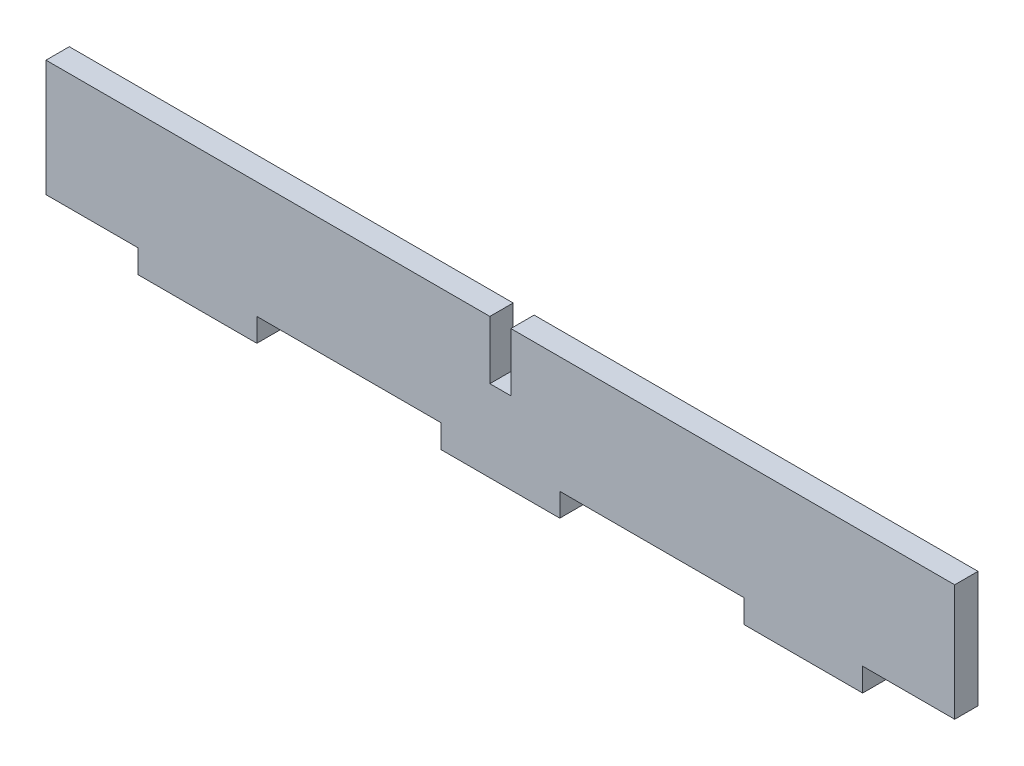
ISO-10303-21;
HEADER;
FILE_DESCRIPTION(('STEP AP214'),'2;1');
FILE_NAME('part.step','',(''),(''),'','','');
FILE_SCHEMA(('AUTOMOTIVE_DESIGN { 1 0 10303 214 1 1 1 1 }'));
ENDSEC;
DATA;
#1=APPLICATION_CONTEXT('core data for automotive mechanical design processes');
#2=APPLICATION_PROTOCOL_DEFINITION('international standard','automotive_design',2000,#1);
#3=PRODUCT_CONTEXT('',#1,'mechanical');
#4=PRODUCT('Part','Part','',(#3));
#5=PRODUCT_RELATED_PRODUCT_CATEGORY('part','',(#4));
#6=PRODUCT_DEFINITION_FORMATION('','',#4);
#7=PRODUCT_DEFINITION_CONTEXT('part definition',#1,'design');
#8=PRODUCT_DEFINITION('design','',#6,#7);
#9=PRODUCT_DEFINITION_SHAPE('','',#8);
#10=(LENGTH_UNIT() NAMED_UNIT(*) SI_UNIT(.MILLI.,.METRE.));
#11=(NAMED_UNIT(*) PLANE_ANGLE_UNIT() SI_UNIT($,.RADIAN.));
#12=(NAMED_UNIT(*) SI_UNIT($,.STERADIAN.) SOLID_ANGLE_UNIT());
#13=UNCERTAINTY_MEASURE_WITH_UNIT(LENGTH_MEASURE(1.E-05),#10,'distance_accuracy_value','');
#14=(GEOMETRIC_REPRESENTATION_CONTEXT(3) GLOBAL_UNCERTAINTY_ASSIGNED_CONTEXT((#13)) GLOBAL_UNIT_ASSIGNED_CONTEXT((#10,
#11,#12)) REPRESENTATION_CONTEXT('',''));
#15=CARTESIAN_POINT('',(0.,0.,0.));
#16=DIRECTION('',(0.,0.,1.));
#17=DIRECTION('',(1.,0.,0.));
#18=AXIS2_PLACEMENT_3D('',#15,#16,#17);
#19=CARTESIAN_POINT('',(-39.,1.99999999999999,2.));
#20=DIRECTION('',(1.,0.,0.));
#21=DIRECTION('',(0.,0.,-1.));
#22=AXIS2_PLACEMENT_3D('',#19,#20,#21);
#23=PLANE('',#22);
#24=DIRECTION('',(0.,-1.,0.));
#25=VECTOR('',#24,1.);
#26=CARTESIAN_POINT('',(-39.,1.99999999999999,0.));
#27=LINE('',#26,#25);
#28=CARTESIAN_POINT('',(-39.,12.,0.));
#29=VERTEX_POINT('',#28);
#30=CARTESIAN_POINT('',(-39.,1.99999999999999,0.));
#31=VERTEX_POINT('',#30);
#32=EDGE_CURVE('E200',#29,#31,#27,.T.);
#33=ORIENTED_EDGE('',*,*,#32,.T.);
#34=DIRECTION('',(0.,0.,-1.));
#35=VECTOR('',#34,1.);
#36=CARTESIAN_POINT('',(-39.,1.99999999999999,2.));
#37=LINE('',#36,#35);
#38=CARTESIAN_POINT('',(-39.,1.99999999999999,2.));
#39=VERTEX_POINT('',#38);
#40=EDGE_CURVE('E11',#39,#31,#37,.T.);
#41=ORIENTED_EDGE('',*,*,#40,.F.);
#42=DIRECTION('',(0.,-1.,0.));
#43=VECTOR('',#42,1.);
#44=CARTESIAN_POINT('',(-39.,1.99999999999999,2.));
#45=LINE('',#44,#43);
#46=CARTESIAN_POINT('',(-39.,12.,2.));
#47=VERTEX_POINT('',#46);
#48=EDGE_CURVE('E238',#47,#39,#45,.T.);
#49=ORIENTED_EDGE('',*,*,#48,.F.);
#50=DIRECTION('',(0.,0.,-1.));
#51=VECTOR('',#50,1.);
#52=CARTESIAN_POINT('',(-39.,12.,2.));
#53=LINE('',#52,#51);
#54=EDGE_CURVE('E196',#47,#29,#53,.T.);
#55=ORIENTED_EDGE('',*,*,#54,.T.);
#56=EDGE_LOOP('',(#33,#41,#49,#55));
#57=FACE_BOUND('',#56,.T.);
#58=ADVANCED_FACE('F32',(#57),#23,.F.);
#59=CARTESIAN_POINT('',(-39.,1.99999999999999,2.));
#60=DIRECTION('',(0.,1.,0.));
#61=DIRECTION('',(-1.,0.,0.));
#62=AXIS2_PLACEMENT_3D('',#59,#60,#61);
#63=PLANE('',#62);
#64=DIRECTION('',(1.,0.,0.));
#65=VECTOR('',#64,1.);
#66=CARTESIAN_POINT('',(-39.,1.99999999999999,0.));
#67=LINE('',#66,#65);
#68=CARTESIAN_POINT('',(-31.1,1.99999999999999,0.));
#69=VERTEX_POINT('',#68);
#70=EDGE_CURVE('E203',#31,#69,#67,.T.);
#71=ORIENTED_EDGE('',*,*,#70,.T.);
#72=DIRECTION('',(0.,0.,-1.));
#73=VECTOR('',#72,1.);
#74=CARTESIAN_POINT('',(-31.1,1.99999999999999,2.));
#75=LINE('',#74,#73);
#76=CARTESIAN_POINT('',(-31.1,1.99999999999999,2.));
#77=VERTEX_POINT('',#76);
#78=EDGE_CURVE('E40',#77,#69,#75,.T.);
#79=ORIENTED_EDGE('',*,*,#78,.F.);
#80=DIRECTION('',(1.,0.,0.));
#81=VECTOR('',#80,1.);
#82=CARTESIAN_POINT('',(-39.,1.99999999999999,2.));
#83=LINE('',#82,#81);
#84=EDGE_CURVE('E127',#39,#77,#83,.T.);
#85=ORIENTED_EDGE('',*,*,#84,.F.);
#86=ORIENTED_EDGE('',*,*,#40,.T.);
#87=EDGE_LOOP('',(#71,#79,#85,#86));
#88=FACE_BOUND('',#87,.T.);
#89=ADVANCED_FACE('F356',(#88),#63,.F.);
#90=CARTESIAN_POINT('',(-31.1,1.99999999999999,2.));
#91=DIRECTION('',(1.,0.,0.));
#92=DIRECTION('',(0.,0.,-1.));
#93=AXIS2_PLACEMENT_3D('',#90,#91,#92);
#94=PLANE('',#93);
#95=DIRECTION('',(0.,-1.,0.));
#96=VECTOR('',#95,1.);
#97=CARTESIAN_POINT('',(-31.1,1.99999999999999,0.));
#98=LINE('',#97,#96);
#99=CARTESIAN_POINT('',(-31.1,0.,0.));
#100=VERTEX_POINT('',#99);
#101=EDGE_CURVE('E205',#69,#100,#98,.T.);
#102=ORIENTED_EDGE('',*,*,#101,.T.);
#103=DIRECTION('',(0.,0.,-1.));
#104=VECTOR('',#103,1.);
#105=CARTESIAN_POINT('',(-31.1,0.,2.));
#106=LINE('',#105,#104);
#107=CARTESIAN_POINT('',(-31.1,0.,2.));
#108=VERTEX_POINT('',#107);
#109=EDGE_CURVE('E281',#108,#100,#106,.T.);
#110=ORIENTED_EDGE('',*,*,#109,.F.);
#111=DIRECTION('',(0.,-1.,0.));
#112=VECTOR('',#111,1.);
#113=CARTESIAN_POINT('',(-31.1,1.99999999999999,2.));
#114=LINE('',#113,#112);
#115=EDGE_CURVE('E289',#77,#108,#114,.T.);
#116=ORIENTED_EDGE('',*,*,#115,.F.);
#117=ORIENTED_EDGE('',*,*,#78,.T.);
#118=EDGE_LOOP('',(#102,#110,#116,#117));
#119=FACE_BOUND('',#118,.T.);
#120=ADVANCED_FACE('F287',(#119),#94,.F.);
#121=CARTESIAN_POINT('',(-31.1,0.,2.));
#122=DIRECTION('',(0.,1.,0.));
#123=DIRECTION('',(-1.,0.,0.));
#124=AXIS2_PLACEMENT_3D('',#121,#122,#123);
#125=PLANE('',#124);
#126=DIRECTION('',(1.,0.,0.));
#127=VECTOR('',#126,1.);
#128=CARTESIAN_POINT('',(-31.1,0.,0.));
#129=LINE('',#128,#127);
#130=CARTESIAN_POINT('',(-20.9,0.,0.));
#131=VERTEX_POINT('',#130);
#132=EDGE_CURVE('E207',#100,#131,#129,.T.);
#133=ORIENTED_EDGE('',*,*,#132,.T.);
#134=DIRECTION('',(0.,0.,-1.));
#135=VECTOR('',#134,1.);
#136=CARTESIAN_POINT('',(-20.9,0.,2.));
#137=LINE('',#136,#135);
#138=CARTESIAN_POINT('',(-20.9,0.,2.));
#139=VERTEX_POINT('',#138);
#140=EDGE_CURVE('E278',#139,#131,#137,.T.);
#141=ORIENTED_EDGE('',*,*,#140,.F.);
#142=DIRECTION('',(1.,0.,0.));
#143=VECTOR('',#142,1.);
#144=CARTESIAN_POINT('',(-31.1,0.,2.));
#145=LINE('',#144,#143);
#146=EDGE_CURVE('E307',#108,#139,#145,.T.);
#147=ORIENTED_EDGE('',*,*,#146,.F.);
#148=ORIENTED_EDGE('',*,*,#109,.T.);
#149=EDGE_LOOP('',(#133,#141,#147,#148));
#150=FACE_BOUND('',#149,.T.);
#151=ADVANCED_FACE('F298',(#150),#125,.F.);
#152=CARTESIAN_POINT('',(-20.9,2.,2.));
#153=DIRECTION('',(-1.,0.,0.));
#154=DIRECTION('',(0.,0.,1.));
#155=AXIS2_PLACEMENT_3D('',#152,#153,#154);
#156=PLANE('',#155);
#157=DIRECTION('',(0.,1.,0.));
#158=VECTOR('',#157,1.);
#159=CARTESIAN_POINT('',(-20.9,2.,0.));
#160=LINE('',#159,#158);
#161=CARTESIAN_POINT('',(-20.9,2.,0.));
#162=VERTEX_POINT('',#161);
#163=EDGE_CURVE('E209',#131,#162,#160,.T.);
#164=ORIENTED_EDGE('',*,*,#163,.T.);
#165=DIRECTION('',(0.,0.,-1.));
#166=VECTOR('',#165,1.);
#167=CARTESIAN_POINT('',(-20.9,2.,2.));
#168=LINE('',#167,#166);
#169=CARTESIAN_POINT('',(-20.9,2.,2.));
#170=VERTEX_POINT('',#169);
#171=EDGE_CURVE('E275',#170,#162,#168,.T.);
#172=ORIENTED_EDGE('',*,*,#171,.F.);
#173=DIRECTION('',(0.,1.,0.));
#174=VECTOR('',#173,1.);
#175=CARTESIAN_POINT('',(-20.9,2.,2.));
#176=LINE('',#175,#174);
#177=EDGE_CURVE('E304',#139,#170,#176,.T.);
#178=ORIENTED_EDGE('',*,*,#177,.F.);
#179=ORIENTED_EDGE('',*,*,#140,.T.);
#180=EDGE_LOOP('',(#164,#172,#178,#179));
#181=FACE_BOUND('',#180,.T.);
#182=ADVANCED_FACE('F302',(#181),#156,.F.);
#183=CARTESIAN_POINT('',(-20.9,2.,2.));
#184=DIRECTION('',(0.,1.,0.));
#185=DIRECTION('',(-1.,0.,0.));
#186=AXIS2_PLACEMENT_3D('',#183,#184,#185);
#187=PLANE('',#186);
#188=DIRECTION('',(1.,0.,0.));
#189=VECTOR('',#188,1.);
#190=CARTESIAN_POINT('',(-20.9,2.,0.));
#191=LINE('',#190,#189);
#192=CARTESIAN_POINT('',(-5.1,2.,0.));
#193=VERTEX_POINT('',#192);
#194=EDGE_CURVE('E211',#162,#193,#191,.T.);
#195=ORIENTED_EDGE('',*,*,#194,.T.);
#196=DIRECTION('',(0.,0.,-1.));
#197=VECTOR('',#196,1.);
#198=CARTESIAN_POINT('',(-5.1,2.,2.));
#199=LINE('',#198,#197);
#200=CARTESIAN_POINT('',(-5.1,2.,2.));
#201=VERTEX_POINT('',#200);
#202=EDGE_CURVE('E272',#201,#193,#199,.T.);
#203=ORIENTED_EDGE('',*,*,#202,.F.);
#204=DIRECTION('',(1.,0.,0.));
#205=VECTOR('',#204,1.);
#206=CARTESIAN_POINT('',(-20.9,2.,2.));
#207=LINE('',#206,#205);
#208=EDGE_CURVE('E306',#170,#201,#207,.T.);
#209=ORIENTED_EDGE('',*,*,#208,.F.);
#210=ORIENTED_EDGE('',*,*,#171,.T.);
#211=EDGE_LOOP('',(#195,#203,#209,#210));
#212=FACE_BOUND('',#211,.T.);
#213=ADVANCED_FACE('F369',(#212),#187,.F.);
#214=CARTESIAN_POINT('',(-5.1,2.,2.));
#215=DIRECTION('',(1.,0.,0.));
#216=DIRECTION('',(0.,0.,-1.));
#217=AXIS2_PLACEMENT_3D('',#214,#215,#216);
#218=PLANE('',#217);
#219=DIRECTION('',(0.,-1.,0.));
#220=VECTOR('',#219,1.);
#221=CARTESIAN_POINT('',(-5.1,2.,0.));
#222=LINE('',#221,#220);
#223=CARTESIAN_POINT('',(-5.1,0.,0.));
#224=VERTEX_POINT('',#223);
#225=EDGE_CURVE('E213',#193,#224,#222,.T.);
#226=ORIENTED_EDGE('',*,*,#225,.T.);
#227=DIRECTION('',(0.,0.,-1.));
#228=VECTOR('',#227,1.);
#229=CARTESIAN_POINT('',(-5.1,0.,2.));
#230=LINE('',#229,#228);
#231=CARTESIAN_POINT('',(-5.1,0.,2.));
#232=VERTEX_POINT('',#231);
#233=EDGE_CURVE('E269',#232,#224,#230,.T.);
#234=ORIENTED_EDGE('',*,*,#233,.F.);
#235=DIRECTION('',(0.,-1.,0.));
#236=VECTOR('',#235,1.);
#237=CARTESIAN_POINT('',(-5.1,2.,2.));
#238=LINE('',#237,#236);
#239=EDGE_CURVE('E309',#201,#232,#238,.T.);
#240=ORIENTED_EDGE('',*,*,#239,.F.);
#241=ORIENTED_EDGE('',*,*,#202,.T.);
#242=EDGE_LOOP('',(#226,#234,#240,#241));
#243=FACE_BOUND('',#242,.T.);
#244=ADVANCED_FACE('F372',(#243),#218,.F.);
#245=CARTESIAN_POINT('',(-5.1,0.,2.));
#246=DIRECTION('',(0.,1.,0.));
#247=DIRECTION('',(0.,0.,1.));
#248=AXIS2_PLACEMENT_3D('',#245,#246,#247);
#249=PLANE('',#248);
#250=DIRECTION('',(1.,0.,0.));
#251=VECTOR('',#250,1.);
#252=CARTESIAN_POINT('',(-5.1,0.,0.));
#253=LINE('',#252,#251);
#254=CARTESIAN_POINT('',(5.1,0.,0.));
#255=VERTEX_POINT('',#254);
#256=EDGE_CURVE('E215',#224,#255,#253,.T.);
#257=ORIENTED_EDGE('',*,*,#256,.T.);
#258=DIRECTION('',(0.,0.,-1.));
#259=VECTOR('',#258,1.);
#260=CARTESIAN_POINT('',(5.1,0.,2.));
#261=LINE('',#260,#259);
#262=CARTESIAN_POINT('',(5.1,0.,2.));
#263=VERTEX_POINT('',#262);
#264=EDGE_CURVE('E266',#263,#255,#261,.T.);
#265=ORIENTED_EDGE('',*,*,#264,.F.);
#266=DIRECTION('',(1.,0.,0.));
#267=VECTOR('',#266,1.);
#268=CARTESIAN_POINT('',(-5.1,0.,2.));
#269=LINE('',#268,#267);
#270=EDGE_CURVE('E315',#232,#263,#269,.T.);
#271=ORIENTED_EDGE('',*,*,#270,.F.);
#272=ORIENTED_EDGE('',*,*,#233,.T.);
#273=EDGE_LOOP('',(#257,#265,#271,#272));
#274=FACE_BOUND('',#273,.T.);
#275=ADVANCED_FACE('F376',(#274),#249,.F.);
#276=CARTESIAN_POINT('',(5.1,2.,2.));
#277=DIRECTION('',(-1.,0.,0.));
#278=DIRECTION('',(0.,0.,1.));
#279=AXIS2_PLACEMENT_3D('',#276,#277,#278);
#280=PLANE('',#279);
#281=DIRECTION('',(0.,1.,0.));
#282=VECTOR('',#281,1.);
#283=CARTESIAN_POINT('',(5.1,2.,0.));
#284=LINE('',#283,#282);
#285=CARTESIAN_POINT('',(5.1,2.,0.));
#286=VERTEX_POINT('',#285);
#287=EDGE_CURVE('E217',#255,#286,#284,.T.);
#288=ORIENTED_EDGE('',*,*,#287,.T.);
#289=DIRECTION('',(0.,0.,-1.));
#290=VECTOR('',#289,1.);
#291=CARTESIAN_POINT('',(5.1,2.,2.));
#292=LINE('',#291,#290);
#293=CARTESIAN_POINT('',(5.1,2.,2.));
#294=VERTEX_POINT('',#293);
#295=EDGE_CURVE('E263',#294,#286,#292,.T.);
#296=ORIENTED_EDGE('',*,*,#295,.F.);
#297=DIRECTION('',(0.,1.,0.));
#298=VECTOR('',#297,1.);
#299=CARTESIAN_POINT('',(5.1,2.,2.));
#300=LINE('',#299,#298);
#301=EDGE_CURVE('E317',#263,#294,#300,.T.);
#302=ORIENTED_EDGE('',*,*,#301,.F.);
#303=ORIENTED_EDGE('',*,*,#264,.T.);
#304=EDGE_LOOP('',(#288,#296,#302,#303));
#305=FACE_BOUND('',#304,.T.);
#306=ADVANCED_FACE('F380',(#305),#280,.F.);
#307=CARTESIAN_POINT('',(5.1,2.,2.));
#308=DIRECTION('',(0.,1.,0.));
#309=DIRECTION('',(-1.,0.,0.));
#310=AXIS2_PLACEMENT_3D('',#307,#308,#309);
#311=PLANE('',#310);
#312=DIRECTION('',(1.,0.,0.));
#313=VECTOR('',#312,1.);
#314=CARTESIAN_POINT('',(5.1,2.,0.));
#315=LINE('',#314,#313);
#316=CARTESIAN_POINT('',(20.9,2.,0.));
#317=VERTEX_POINT('',#316);
#318=EDGE_CURVE('E219',#286,#317,#315,.T.);
#319=ORIENTED_EDGE('',*,*,#318,.T.);
#320=DIRECTION('',(0.,0.,-1.));
#321=VECTOR('',#320,1.);
#322=CARTESIAN_POINT('',(20.9,2.,2.));
#323=LINE('',#322,#321);
#324=CARTESIAN_POINT('',(20.9,2.,2.));
#325=VERTEX_POINT('',#324);
#326=EDGE_CURVE('E260',#325,#317,#323,.T.);
#327=ORIENTED_EDGE('',*,*,#326,.F.);
#328=DIRECTION('',(1.,0.,0.));
#329=VECTOR('',#328,1.);
#330=CARTESIAN_POINT('',(5.1,2.,2.));
#331=LINE('',#330,#329);
#332=EDGE_CURVE('E319',#294,#325,#331,.T.);
#333=ORIENTED_EDGE('',*,*,#332,.F.);
#334=ORIENTED_EDGE('',*,*,#295,.T.);
#335=EDGE_LOOP('',(#319,#327,#333,#334));
#336=FACE_BOUND('',#335,.T.);
#337=ADVANCED_FACE('F384',(#336),#311,.F.);
#338=CARTESIAN_POINT('',(20.9,2.,2.));
#339=DIRECTION('',(1.,0.,0.));
#340=DIRECTION('',(0.,0.,-1.));
#341=AXIS2_PLACEMENT_3D('',#338,#339,#340);
#342=PLANE('',#341);
#343=DIRECTION('',(0.,-1.,0.));
#344=VECTOR('',#343,1.);
#345=CARTESIAN_POINT('',(20.9,2.,0.));
#346=LINE('',#345,#344);
#347=CARTESIAN_POINT('',(20.9,0.,0.));
#348=VERTEX_POINT('',#347);
#349=EDGE_CURVE('E221',#317,#348,#346,.T.);
#350=ORIENTED_EDGE('',*,*,#349,.T.);
#351=DIRECTION('',(0.,0.,-1.));
#352=VECTOR('',#351,1.);
#353=CARTESIAN_POINT('',(20.9,0.,2.));
#354=LINE('',#353,#352);
#355=CARTESIAN_POINT('',(20.9,0.,2.));
#356=VERTEX_POINT('',#355);
#357=EDGE_CURVE('E257',#356,#348,#354,.T.);
#358=ORIENTED_EDGE('',*,*,#357,.F.);
#359=DIRECTION('',(0.,-1.,0.));
#360=VECTOR('',#359,1.);
#361=CARTESIAN_POINT('',(20.9,2.,2.));
#362=LINE('',#361,#360);
#363=EDGE_CURVE('E321',#325,#356,#362,.T.);
#364=ORIENTED_EDGE('',*,*,#363,.F.);
#365=ORIENTED_EDGE('',*,*,#326,.T.);
#366=EDGE_LOOP('',(#350,#358,#364,#365));
#367=FACE_BOUND('',#366,.T.);
#368=ADVANCED_FACE('F388',(#367),#342,.F.);
#369=CARTESIAN_POINT('',(20.9,0.,2.));
#370=DIRECTION('',(0.,1.,0.));
#371=DIRECTION('',(-1.,0.,0.));
#372=AXIS2_PLACEMENT_3D('',#369,#370,#371);
#373=PLANE('',#372);
#374=DIRECTION('',(1.,0.,0.));
#375=VECTOR('',#374,1.);
#376=CARTESIAN_POINT('',(20.9,0.,0.));
#377=LINE('',#376,#375);
#378=CARTESIAN_POINT('',(31.1,0.,0.));
#379=VERTEX_POINT('',#378);
#380=EDGE_CURVE('E223',#348,#379,#377,.T.);
#381=ORIENTED_EDGE('',*,*,#380,.T.);
#382=DIRECTION('',(0.,0.,-1.));
#383=VECTOR('',#382,1.);
#384=CARTESIAN_POINT('',(31.1,0.,2.));
#385=LINE('',#384,#383);
#386=CARTESIAN_POINT('',(31.1,0.,2.));
#387=VERTEX_POINT('',#386);
#388=EDGE_CURVE('E254',#387,#379,#385,.T.);
#389=ORIENTED_EDGE('',*,*,#388,.F.);
#390=DIRECTION('',(1.,0.,0.));
#391=VECTOR('',#390,1.);
#392=CARTESIAN_POINT('',(20.9,0.,2.));
#393=LINE('',#392,#391);
#394=EDGE_CURVE('E323',#356,#387,#393,.T.);
#395=ORIENTED_EDGE('',*,*,#394,.F.);
#396=ORIENTED_EDGE('',*,*,#357,.T.);
#397=EDGE_LOOP('',(#381,#389,#395,#396));
#398=FACE_BOUND('',#397,.T.);
#399=ADVANCED_FACE('F392',(#398),#373,.F.);
#400=CARTESIAN_POINT('',(31.1,1.99999999999999,2.));
#401=DIRECTION('',(-1.,0.,0.));
#402=DIRECTION('',(0.,0.,1.));
#403=AXIS2_PLACEMENT_3D('',#400,#401,#402);
#404=PLANE('',#403);
#405=DIRECTION('',(0.,1.,0.));
#406=VECTOR('',#405,1.);
#407=CARTESIAN_POINT('',(31.1,1.99999999999999,0.));
#408=LINE('',#407,#406);
#409=CARTESIAN_POINT('',(31.1,1.99999999999999,0.));
#410=VERTEX_POINT('',#409);
#411=EDGE_CURVE('E225',#379,#410,#408,.T.);
#412=ORIENTED_EDGE('',*,*,#411,.T.);
#413=DIRECTION('',(0.,0.,-1.));
#414=VECTOR('',#413,1.);
#415=CARTESIAN_POINT('',(31.1,1.99999999999999,2.));
#416=LINE('',#415,#414);
#417=CARTESIAN_POINT('',(31.1,1.99999999999999,2.));
#418=VERTEX_POINT('',#417);
#419=EDGE_CURVE('E251',#418,#410,#416,.T.);
#420=ORIENTED_EDGE('',*,*,#419,.F.);
#421=DIRECTION('',(0.,1.,0.));
#422=VECTOR('',#421,1.);
#423=CARTESIAN_POINT('',(31.1,1.99999999999999,2.));
#424=LINE('',#423,#422);
#425=EDGE_CURVE('E325',#387,#418,#424,.T.);
#426=ORIENTED_EDGE('',*,*,#425,.F.);
#427=ORIENTED_EDGE('',*,*,#388,.T.);
#428=EDGE_LOOP('',(#412,#420,#426,#427));
#429=FACE_BOUND('',#428,.T.);
#430=ADVANCED_FACE('F396',(#429),#404,.F.);
#431=CARTESIAN_POINT('',(31.1,1.99999999999999,2.));
#432=DIRECTION('',(0.,1.,0.));
#433=DIRECTION('',(-1.,0.,0.));
#434=AXIS2_PLACEMENT_3D('',#431,#432,#433);
#435=PLANE('',#434);
#436=DIRECTION('',(1.,0.,0.));
#437=VECTOR('',#436,1.);
#438=CARTESIAN_POINT('',(31.1,1.99999999999999,0.));
#439=LINE('',#438,#437);
#440=CARTESIAN_POINT('',(39.,1.99999999999999,0.));
#441=VERTEX_POINT('',#440);
#442=EDGE_CURVE('E227',#410,#441,#439,.T.);
#443=ORIENTED_EDGE('',*,*,#442,.T.);
#444=DIRECTION('',(0.,0.,-1.));
#445=VECTOR('',#444,1.);
#446=CARTESIAN_POINT('',(39.,1.99999999999999,2.));
#447=LINE('',#446,#445);
#448=CARTESIAN_POINT('',(39.,1.99999999999999,2.));
#449=VERTEX_POINT('',#448);
#450=EDGE_CURVE('E248',#449,#441,#447,.T.);
#451=ORIENTED_EDGE('',*,*,#450,.F.);
#452=DIRECTION('',(1.,0.,0.));
#453=VECTOR('',#452,1.);
#454=CARTESIAN_POINT('',(31.1,1.99999999999999,2.));
#455=LINE('',#454,#453);
#456=EDGE_CURVE('E327',#418,#449,#455,.T.);
#457=ORIENTED_EDGE('',*,*,#456,.F.);
#458=ORIENTED_EDGE('',*,*,#419,.T.);
#459=EDGE_LOOP('',(#443,#451,#457,#458));
#460=FACE_BOUND('',#459,.T.);
#461=ADVANCED_FACE('F400',(#460),#435,.F.);
#462=CARTESIAN_POINT('',(39.,1.99999999999999,2.));
#463=DIRECTION('',(-1.,0.,0.));
#464=DIRECTION('',(0.,0.,1.));
#465=AXIS2_PLACEMENT_3D('',#462,#463,#464);
#466=PLANE('',#465);
#467=DIRECTION('',(0.,1.,0.));
#468=VECTOR('',#467,1.);
#469=CARTESIAN_POINT('',(39.,1.99999999999999,0.));
#470=LINE('',#469,#468);
#471=CARTESIAN_POINT('',(39.,12.,0.));
#472=VERTEX_POINT('',#471);
#473=EDGE_CURVE('E229',#441,#472,#470,.T.);
#474=ORIENTED_EDGE('',*,*,#473,.T.);
#475=DIRECTION('',(0.,0.,-1.));
#476=VECTOR('',#475,1.);
#477=CARTESIAN_POINT('',(39.,12.,2.));
#478=LINE('',#477,#476);
#479=CARTESIAN_POINT('',(39.,12.,2.));
#480=VERTEX_POINT('',#479);
#481=EDGE_CURVE('E245',#480,#472,#478,.T.);
#482=ORIENTED_EDGE('',*,*,#481,.F.);
#483=DIRECTION('',(0.,1.,0.));
#484=VECTOR('',#483,1.);
#485=CARTESIAN_POINT('',(39.,1.99999999999999,2.));
#486=LINE('',#485,#484);
#487=EDGE_CURVE('E329',#449,#480,#486,.T.);
#488=ORIENTED_EDGE('',*,*,#487,.F.);
#489=ORIENTED_EDGE('',*,*,#450,.T.);
#490=EDGE_LOOP('',(#474,#482,#488,#489));
#491=FACE_BOUND('',#490,.T.);
#492=ADVANCED_FACE('F404',(#491),#466,.F.);
#493=CARTESIAN_POINT('',(0.900000000000001,12.,2.));
#494=DIRECTION('',(0.,-1.,0.));
#495=DIRECTION('',(1.,0.,0.));
#496=AXIS2_PLACEMENT_3D('',#493,#494,#495);
#497=PLANE('',#496);
#498=DIRECTION('',(-1.,0.,0.));
#499=VECTOR('',#498,1.);
#500=CARTESIAN_POINT('',(0.900000000000001,12.,0.));
#501=LINE('',#500,#499);
#502=CARTESIAN_POINT('',(0.900000000000001,12.,0.));
#503=VERTEX_POINT('',#502);
#504=EDGE_CURVE('E231',#472,#503,#501,.T.);
#505=ORIENTED_EDGE('',*,*,#504,.T.);
#506=DIRECTION('',(0.,0.,-1.));
#507=VECTOR('',#506,1.);
#508=CARTESIAN_POINT('',(0.900000000000001,12.,2.));
#509=LINE('',#508,#507);
#510=CARTESIAN_POINT('',(0.900000000000001,12.,2.));
#511=VERTEX_POINT('',#510);
#512=EDGE_CURVE('E242',#511,#503,#509,.T.);
#513=ORIENTED_EDGE('',*,*,#512,.F.);
#514=DIRECTION('',(-1.,0.,0.));
#515=VECTOR('',#514,1.);
#516=CARTESIAN_POINT('',(0.900000000000001,12.,2.));
#517=LINE('',#516,#515);
#518=EDGE_CURVE('E331',#480,#511,#517,.T.);
#519=ORIENTED_EDGE('',*,*,#518,.F.);
#520=ORIENTED_EDGE('',*,*,#481,.T.);
#521=EDGE_LOOP('',(#505,#513,#519,#520));
#522=FACE_BOUND('',#521,.T.);
#523=ADVANCED_FACE('F337',(#522),#497,.F.);
#524=CARTESIAN_POINT('',(0.900000000000001,12.,2.));
#525=DIRECTION('',(1.,0.,0.));
#526=DIRECTION('',(0.,1.,0.));
#527=AXIS2_PLACEMENT_3D('',#524,#525,#526);
#528=PLANE('',#527);
#529=DIRECTION('',(0.,-1.,0.));
#530=VECTOR('',#529,1.);
#531=CARTESIAN_POINT('',(0.900000000000001,12.,0.));
#532=LINE('',#531,#530);
#533=CARTESIAN_POINT('',(0.9,6.99999999999999,0.));
#534=VERTEX_POINT('',#533);
#535=EDGE_CURVE('E233',#503,#534,#532,.T.);
#536=ORIENTED_EDGE('',*,*,#535,.T.);
#537=DIRECTION('',(0.,0.,-1.));
#538=VECTOR('',#537,1.);
#539=CARTESIAN_POINT('',(0.9,6.99999999999999,2.));
#540=LINE('',#539,#538);
#541=CARTESIAN_POINT('',(0.9,6.99999999999999,2.));
#542=VERTEX_POINT('',#541);
#543=EDGE_CURVE('E191',#542,#534,#540,.T.);
#544=ORIENTED_EDGE('',*,*,#543,.F.);
#545=DIRECTION('',(0.,-1.,0.));
#546=VECTOR('',#545,1.);
#547=CARTESIAN_POINT('',(0.900000000000001,12.,2.));
#548=LINE('',#547,#546);
#549=EDGE_CURVE('E182',#511,#542,#548,.T.);
#550=ORIENTED_EDGE('',*,*,#549,.F.);
#551=ORIENTED_EDGE('',*,*,#512,.T.);
#552=EDGE_LOOP('',(#536,#544,#550,#551));
#553=FACE_BOUND('',#552,.T.);
#554=ADVANCED_FACE('F341',(#553),#528,.F.);
#555=CARTESIAN_POINT('',(-0.9,6.99999999999999,2.));
#556=DIRECTION('',(0.,-1.,0.));
#557=DIRECTION('',(1.,0.,0.));
#558=AXIS2_PLACEMENT_3D('',#555,#556,#557);
#559=PLANE('',#558);
#560=DIRECTION('',(-1.,0.,0.));
#561=VECTOR('',#560,1.);
#562=CARTESIAN_POINT('',(-0.9,6.99999999999999,0.));
#563=LINE('',#562,#561);
#564=CARTESIAN_POINT('',(-0.9,6.99999999999999,0.));
#565=VERTEX_POINT('',#564);
#566=EDGE_CURVE('E190',#534,#565,#563,.T.);
#567=ORIENTED_EDGE('',*,*,#566,.T.);
#568=DIRECTION('',(0.,0.,-1.));
#569=VECTOR('',#568,1.);
#570=CARTESIAN_POINT('',(-0.9,6.99999999999999,2.));
#571=LINE('',#570,#569);
#572=CARTESIAN_POINT('',(-0.9,6.99999999999999,2.));
#573=VERTEX_POINT('',#572);
#574=EDGE_CURVE('E187',#573,#565,#571,.T.);
#575=ORIENTED_EDGE('',*,*,#574,.F.);
#576=DIRECTION('',(-1.,0.,0.));
#577=VECTOR('',#576,1.);
#578=CARTESIAN_POINT('',(-0.9,6.99999999999999,2.));
#579=LINE('',#578,#577);
#580=EDGE_CURVE('E176',#542,#573,#579,.T.);
#581=ORIENTED_EDGE('',*,*,#580,.F.);
#582=ORIENTED_EDGE('',*,*,#543,.T.);
#583=EDGE_LOOP('',(#567,#575,#581,#582));
#584=FACE_BOUND('',#583,.T.);
#585=ADVANCED_FACE('F188',(#584),#559,.F.);
#586=CARTESIAN_POINT('',(-0.900000000000001,12.,2.));
#587=DIRECTION('',(-1.,0.,0.));
#588=DIRECTION('',(0.,-1.,0.));
#589=AXIS2_PLACEMENT_3D('',#586,#587,#588);
#590=PLANE('',#589);
#591=DIRECTION('',(0.,1.,0.));
#592=VECTOR('',#591,1.);
#593=CARTESIAN_POINT('',(-0.900000000000001,12.,0.));
#594=LINE('',#593,#592);
#595=CARTESIAN_POINT('',(-0.900000000000001,12.,0.));
#596=VERTEX_POINT('',#595);
#597=EDGE_CURVE('E113',#565,#596,#594,.T.);
#598=ORIENTED_EDGE('',*,*,#597,.T.);
#599=DIRECTION('',(0.,0.,-1.));
#600=VECTOR('',#599,1.);
#601=CARTESIAN_POINT('',(-0.900000000000001,12.,2.));
#602=LINE('',#601,#600);
#603=CARTESIAN_POINT('',(-0.900000000000001,12.,2.));
#604=VERTEX_POINT('',#603);
#605=EDGE_CURVE('E192',#604,#596,#602,.T.);
#606=ORIENTED_EDGE('',*,*,#605,.F.);
#607=DIRECTION('',(0.,1.,0.));
#608=VECTOR('',#607,1.);
#609=CARTESIAN_POINT('',(-0.900000000000001,12.,2.));
#610=LINE('',#609,#608);
#611=EDGE_CURVE('E180',#573,#604,#610,.T.);
#612=ORIENTED_EDGE('',*,*,#611,.F.);
#613=ORIENTED_EDGE('',*,*,#574,.T.);
#614=EDGE_LOOP('',(#598,#606,#612,#613));
#615=FACE_BOUND('',#614,.T.);
#616=ADVANCED_FACE('F194',(#615),#590,.F.);
#617=CARTESIAN_POINT('',(-39.,12.,2.));
#618=DIRECTION('',(0.,-1.,0.));
#619=DIRECTION('',(1.,0.,0.));
#620=AXIS2_PLACEMENT_3D('',#617,#618,#619);
#621=PLANE('',#620);
#622=DIRECTION('',(-1.,0.,0.));
#623=VECTOR('',#622,1.);
#624=CARTESIAN_POINT('',(-39.,12.,0.));
#625=LINE('',#624,#623);
#626=EDGE_CURVE('E119',#596,#29,#625,.T.);
#627=ORIENTED_EDGE('',*,*,#626,.T.);
#628=ORIENTED_EDGE('',*,*,#54,.F.);
#629=DIRECTION('',(-1.,0.,0.));
#630=VECTOR('',#629,1.);
#631=CARTESIAN_POINT('',(-39.,12.,2.));
#632=LINE('',#631,#630);
#633=EDGE_CURVE('E48',#604,#47,#632,.T.);
#634=ORIENTED_EDGE('',*,*,#633,.F.);
#635=ORIENTED_EDGE('',*,*,#605,.T.);
#636=EDGE_LOOP('',(#627,#628,#634,#635));
#637=FACE_BOUND('',#636,.T.);
#638=ADVANCED_FACE('F345',(#637),#621,.F.);
#639=CARTESIAN_POINT('',(0.,0.,2.));
#640=DIRECTION('',(0.,0.,-1.));
#641=DIRECTION('',(-1.,0.,0.));
#642=AXIS2_PLACEMENT_3D('',#639,#640,#641);
#643=PLANE('',#642);
#644=ORIENTED_EDGE('',*,*,#48,.T.);
#645=ORIENTED_EDGE('',*,*,#84,.T.);
#646=ORIENTED_EDGE('',*,*,#115,.T.);
#647=ORIENTED_EDGE('',*,*,#146,.T.);
#648=ORIENTED_EDGE('',*,*,#177,.T.);
#649=ORIENTED_EDGE('',*,*,#208,.T.);
#650=ORIENTED_EDGE('',*,*,#239,.T.);
#651=ORIENTED_EDGE('',*,*,#270,.T.);
#652=ORIENTED_EDGE('',*,*,#301,.T.);
#653=ORIENTED_EDGE('',*,*,#332,.T.);
#654=ORIENTED_EDGE('',*,*,#363,.T.);
#655=ORIENTED_EDGE('',*,*,#394,.T.);
#656=ORIENTED_EDGE('',*,*,#425,.T.);
#657=ORIENTED_EDGE('',*,*,#456,.T.);
#658=ORIENTED_EDGE('',*,*,#487,.T.);
#659=ORIENTED_EDGE('',*,*,#518,.T.);
#660=ORIENTED_EDGE('',*,*,#549,.T.);
#661=ORIENTED_EDGE('',*,*,#580,.T.);
#662=ORIENTED_EDGE('',*,*,#611,.T.);
#663=ORIENTED_EDGE('',*,*,#633,.T.);
#664=EDGE_LOOP('',(#644,#645,#646,#647,#648,#649,#650,#651,#652,#653,#654,#655,#656,#657,#658,
#659,#660,#661,#662,#663));
#665=FACE_BOUND('',#664,.T.);
#666=ADVANCED_FACE('F178',(#665),#643,.F.);
#667=CARTESIAN_POINT('',(0.,0.,0.));
#668=DIRECTION('',(0.,0.,-1.));
#669=DIRECTION('',(-1.,0.,0.));
#670=AXIS2_PLACEMENT_3D('',#667,#668,#669);
#671=PLANE('',#670);
#672=ORIENTED_EDGE('',*,*,#32,.F.);
#673=ORIENTED_EDGE('',*,*,#626,.F.);
#674=ORIENTED_EDGE('',*,*,#597,.F.);
#675=ORIENTED_EDGE('',*,*,#566,.F.);
#676=ORIENTED_EDGE('',*,*,#535,.F.);
#677=ORIENTED_EDGE('',*,*,#504,.F.);
#678=ORIENTED_EDGE('',*,*,#473,.F.);
#679=ORIENTED_EDGE('',*,*,#442,.F.);
#680=ORIENTED_EDGE('',*,*,#411,.F.);
#681=ORIENTED_EDGE('',*,*,#380,.F.);
#682=ORIENTED_EDGE('',*,*,#349,.F.);
#683=ORIENTED_EDGE('',*,*,#318,.F.);
#684=ORIENTED_EDGE('',*,*,#287,.F.);
#685=ORIENTED_EDGE('',*,*,#256,.F.);
#686=ORIENTED_EDGE('',*,*,#225,.F.);
#687=ORIENTED_EDGE('',*,*,#194,.F.);
#688=ORIENTED_EDGE('',*,*,#163,.F.);
#689=ORIENTED_EDGE('',*,*,#132,.F.);
#690=ORIENTED_EDGE('',*,*,#101,.F.);
#691=ORIENTED_EDGE('',*,*,#70,.F.);
#692=EDGE_LOOP('',(#672,#673,#674,#675,#676,#677,#678,#679,#680,#681,#682,#683,#684,#685,#686,
#687,#688,#689,#690,#691));
#693=FACE_BOUND('',#692,.T.);
#694=ADVANCED_FACE('F293',(#693),#671,.T.);
#695=CLOSED_SHELL('',(#58,#89,#120,#151,#182,#213,#244,#275,#306,#337,#368,#399,#430,#461,#492,
#523,#554,#585,#616,#638,#666,#694));
#696=MANIFOLD_SOLID_BREP('B2',#695);
#697=ADVANCED_BREP_SHAPE_REPRESENTATION('',(#18,#696),#14);
#698=SHAPE_DEFINITION_REPRESENTATION(#9,#697);
ENDSEC;
END-ISO-10303-21;
